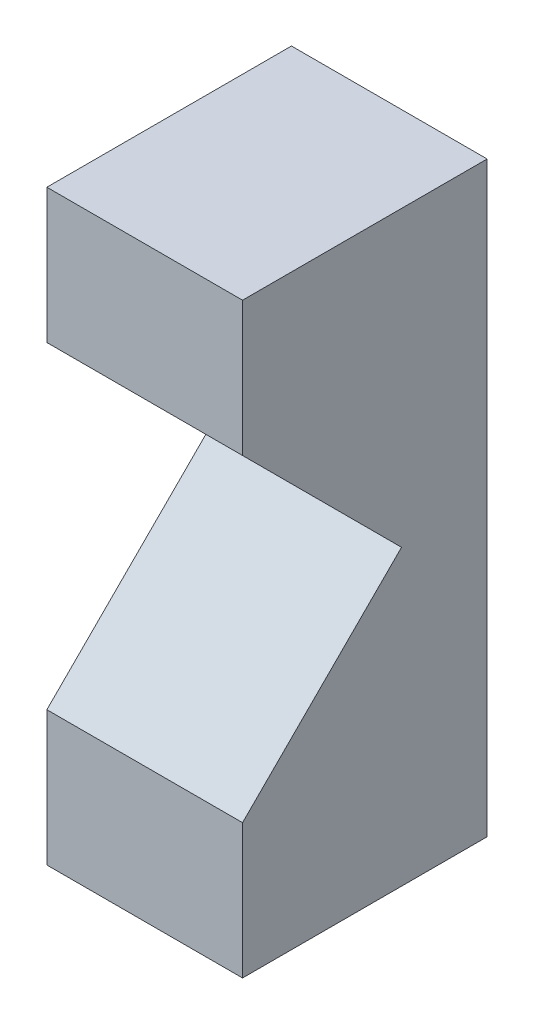
ISO-10303-21;
HEADER;
FILE_DESCRIPTION(('STEP AP214'),'2;1');
FILE_NAME('part.step','',(''),(''),'','','');
FILE_SCHEMA(('AUTOMOTIVE_DESIGN { 1 0 10303 214 1 1 1 1 }'));
ENDSEC;
DATA;
#1=APPLICATION_CONTEXT('core data for automotive mechanical design processes');
#2=APPLICATION_PROTOCOL_DEFINITION('international standard','automotive_design',2000,#1);
#3=PRODUCT_CONTEXT('',#1,'mechanical');
#4=PRODUCT('Part','Part','',(#3));
#5=PRODUCT_RELATED_PRODUCT_CATEGORY('part','',(#4));
#6=PRODUCT_DEFINITION_FORMATION('','',#4);
#7=PRODUCT_DEFINITION_CONTEXT('part definition',#1,'design');
#8=PRODUCT_DEFINITION('design','',#6,#7);
#9=PRODUCT_DEFINITION_SHAPE('','',#8);
#10=(LENGTH_UNIT() NAMED_UNIT(*) SI_UNIT(.MILLI.,.METRE.));
#11=(NAMED_UNIT(*) PLANE_ANGLE_UNIT() SI_UNIT($,.RADIAN.));
#12=(NAMED_UNIT(*) SI_UNIT($,.STERADIAN.) SOLID_ANGLE_UNIT());
#13=UNCERTAINTY_MEASURE_WITH_UNIT(LENGTH_MEASURE(1.E-05),#10,'distance_accuracy_value','');
#14=(GEOMETRIC_REPRESENTATION_CONTEXT(3) GLOBAL_UNCERTAINTY_ASSIGNED_CONTEXT((#13)) GLOBAL_UNIT_ASSIGNED_CONTEXT((#10,
#11,#12)) REPRESENTATION_CONTEXT('',''));
#15=CARTESIAN_POINT('',(0.,0.,0.));
#16=DIRECTION('',(0.,0.,1.));
#17=DIRECTION('',(1.,0.,0.));
#18=AXIS2_PLACEMENT_3D('',#15,#16,#17);
#19=CARTESIAN_POINT('',(12.7,19.05,0.));
#20=DIRECTION('',(0.,0.,-1.));
#21=DIRECTION('',(0.,1.,0.));
#22=AXIS2_PLACEMENT_3D('',#19,#20,#21);
#23=PLANE('',#22);
#24=DIRECTION('',(0.,-1.,0.));
#25=VECTOR('',#24,1.);
#26=CARTESIAN_POINT('',(0.,19.05,0.));
#27=LINE('',#26,#25);
#28=CARTESIAN_POINT('',(0.,19.05,0.));
#29=VERTEX_POINT('',#28);
#30=CARTESIAN_POINT('',(0.,10.31875,0.));
#31=VERTEX_POINT('',#30);
#32=EDGE_CURVE('E123',#29,#31,#27,.T.);
#33=ORIENTED_EDGE('',*,*,#32,.T.);
#34=DIRECTION('',(-1.,0.,0.));
#35=VECTOR('',#34,1.);
#36=CARTESIAN_POINT('',(12.7,10.31875,0.));
#37=LINE('',#36,#35);
#38=CARTESIAN_POINT('',(12.7,10.31875,0.));
#39=VERTEX_POINT('',#38);
#40=EDGE_CURVE('E11',#39,#31,#37,.T.);
#41=ORIENTED_EDGE('',*,*,#40,.F.);
#42=DIRECTION('',(0.,-1.,0.));
#43=VECTOR('',#42,1.);
#44=CARTESIAN_POINT('',(12.7,19.05,0.));
#45=LINE('',#44,#43);
#46=CARTESIAN_POINT('',(12.7,19.05,0.));
#47=VERTEX_POINT('',#46);
#48=EDGE_CURVE('E135',#47,#39,#45,.T.);
#49=ORIENTED_EDGE('',*,*,#48,.F.);
#50=DIRECTION('',(-1.,0.,0.));
#51=VECTOR('',#50,1.);
#52=CARTESIAN_POINT('',(12.7,19.05,0.));
#53=LINE('',#52,#51);
#54=EDGE_CURVE('E119',#47,#29,#53,.T.);
#55=ORIENTED_EDGE('',*,*,#54,.T.);
#56=EDGE_LOOP('',(#33,#41,#49,#55));
#57=FACE_BOUND('',#56,.T.);
#58=ADVANCED_FACE('F33',(#57),#23,.F.);
#59=CARTESIAN_POINT('',(12.7,10.31875,0.));
#60=DIRECTION('',(0.,0.707106781186548,-0.707106781186548));
#61=DIRECTION('',(0.,0.707106781186548,0.707106781186548));
#62=AXIS2_PLACEMENT_3D('',#59,#60,#61);
#63=PLANE('',#62);
#64=DIRECTION('',(0.,-0.707106781186548,-0.707106781186548));
#65=VECTOR('',#64,1.);
#66=CARTESIAN_POINT('',(0.,10.31875,0.));
#67=LINE('',#66,#65);
#68=CARTESIAN_POINT('',(0.,0.,-10.31875));
#69=VERTEX_POINT('',#68);
#70=EDGE_CURVE('E126',#31,#69,#67,.T.);
#71=ORIENTED_EDGE('',*,*,#70,.T.);
#72=DIRECTION('',(-1.,0.,0.));
#73=VECTOR('',#72,1.);
#74=CARTESIAN_POINT('',(12.7,0.,-10.31875));
#75=LINE('',#74,#73);
#76=CARTESIAN_POINT('',(12.7,0.,-10.31875));
#77=VERTEX_POINT('',#76);
#78=EDGE_CURVE('E41',#77,#69,#75,.T.);
#79=ORIENTED_EDGE('',*,*,#78,.F.);
#80=DIRECTION('',(0.,-0.707106781186548,-0.707106781186548));
#81=VECTOR('',#80,1.);
#82=CARTESIAN_POINT('',(12.7,10.31875,0.));
#83=LINE('',#82,#81);
#84=EDGE_CURVE('E89',#39,#77,#83,.T.);
#85=ORIENTED_EDGE('',*,*,#84,.F.);
#86=ORIENTED_EDGE('',*,*,#40,.T.);
#87=EDGE_LOOP('',(#71,#79,#85,#86));
#88=FACE_BOUND('',#87,.T.);
#89=ADVANCED_FACE('F160',(#88),#63,.F.);
#90=CARTESIAN_POINT('',(12.7,0.,-10.31875));
#91=DIRECTION('',(0.,-0.707106781186548,-0.707106781186548));
#92=DIRECTION('',(0.,0.707106781186548,-0.707106781186548));
#93=AXIS2_PLACEMENT_3D('',#90,#91,#92);
#94=PLANE('',#93);
#95=DIRECTION('',(0.,-0.707106781186548,0.707106781186548));
#96=VECTOR('',#95,1.);
#97=CARTESIAN_POINT('',(0.,0.,-10.31875));
#98=LINE('',#97,#96);
#99=CARTESIAN_POINT('',(0.,-10.31875,0.));
#100=VERTEX_POINT('',#99);
#101=EDGE_CURVE('E128',#69,#100,#98,.T.);
#102=ORIENTED_EDGE('',*,*,#101,.T.);
#103=DIRECTION('',(-1.,0.,0.));
#104=VECTOR('',#103,1.);
#105=CARTESIAN_POINT('',(12.7,-10.31875,0.));
#106=LINE('',#105,#104);
#107=CARTESIAN_POINT('',(12.7,-10.31875,0.));
#108=VERTEX_POINT('',#107);
#109=EDGE_CURVE('E139',#108,#100,#106,.T.);
#110=ORIENTED_EDGE('',*,*,#109,.F.);
#111=DIRECTION('',(0.,-0.707106781186548,0.707106781186548));
#112=VECTOR('',#111,1.);
#113=CARTESIAN_POINT('',(12.7,0.,-10.31875));
#114=LINE('',#113,#112);
#115=EDGE_CURVE('E147',#77,#108,#114,.T.);
#116=ORIENTED_EDGE('',*,*,#115,.F.);
#117=ORIENTED_EDGE('',*,*,#78,.T.);
#118=EDGE_LOOP('',(#102,#110,#116,#117));
#119=FACE_BOUND('',#118,.T.);
#120=ADVANCED_FACE('F145',(#119),#94,.F.);
#121=CARTESIAN_POINT('',(12.7,-10.31875,0.));
#122=DIRECTION('',(0.,0.,-1.));
#123=DIRECTION('',(0.,1.,0.));
#124=AXIS2_PLACEMENT_3D('',#121,#122,#123);
#125=PLANE('',#124);
#126=DIRECTION('',(0.,-1.,0.));
#127=VECTOR('',#126,1.);
#128=CARTESIAN_POINT('',(0.,-10.31875,0.));
#129=LINE('',#128,#127);
#130=CARTESIAN_POINT('',(0.,-19.05,0.));
#131=VERTEX_POINT('',#130);
#132=EDGE_CURVE('E130',#100,#131,#129,.T.);
#133=ORIENTED_EDGE('',*,*,#132,.T.);
#134=DIRECTION('',(-1.,0.,0.));
#135=VECTOR('',#134,1.);
#136=CARTESIAN_POINT('',(12.7,-19.05,0.));
#137=LINE('',#136,#135);
#138=CARTESIAN_POINT('',(12.7,-19.05,0.));
#139=VERTEX_POINT('',#138);
#140=EDGE_CURVE('E114',#139,#131,#137,.T.);
#141=ORIENTED_EDGE('',*,*,#140,.F.);
#142=DIRECTION('',(0.,-1.,0.));
#143=VECTOR('',#142,1.);
#144=CARTESIAN_POINT('',(12.7,-10.31875,0.));
#145=LINE('',#144,#143);
#146=EDGE_CURVE('E105',#108,#139,#145,.T.);
#147=ORIENTED_EDGE('',*,*,#146,.F.);
#148=ORIENTED_EDGE('',*,*,#109,.T.);
#149=EDGE_LOOP('',(#133,#141,#147,#148));
#150=FACE_BOUND('',#149,.T.);
#151=ADVANCED_FACE('F153',(#150),#125,.F.);
#152=CARTESIAN_POINT('',(12.7,-19.05,0.));
#153=DIRECTION('',(0.,1.,0.));
#154=DIRECTION('',(0.,0.,1.));
#155=AXIS2_PLACEMENT_3D('',#152,#153,#154);
#156=PLANE('',#155);
#157=DIRECTION('',(0.,0.,-1.));
#158=VECTOR('',#157,1.);
#159=CARTESIAN_POINT('',(0.,-19.05,0.));
#160=LINE('',#159,#158);
#161=CARTESIAN_POINT('',(0.,-19.05,-15.875));
#162=VERTEX_POINT('',#161);
#163=EDGE_CURVE('E113',#131,#162,#160,.T.);
#164=ORIENTED_EDGE('',*,*,#163,.T.);
#165=DIRECTION('',(-1.,0.,0.));
#166=VECTOR('',#165,1.);
#167=CARTESIAN_POINT('',(12.7,-19.05,-15.875));
#168=LINE('',#167,#166);
#169=CARTESIAN_POINT('',(12.7,-19.05,-15.875));
#170=VERTEX_POINT('',#169);
#171=EDGE_CURVE('E110',#170,#162,#168,.T.);
#172=ORIENTED_EDGE('',*,*,#171,.F.);
#173=DIRECTION('',(0.,0.,-1.));
#174=VECTOR('',#173,1.);
#175=CARTESIAN_POINT('',(12.7,-19.05,0.));
#176=LINE('',#175,#174);
#177=EDGE_CURVE('E99',#139,#170,#176,.T.);
#178=ORIENTED_EDGE('',*,*,#177,.F.);
#179=ORIENTED_EDGE('',*,*,#140,.T.);
#180=EDGE_LOOP('',(#164,#172,#178,#179));
#181=FACE_BOUND('',#180,.T.);
#182=ADVANCED_FACE('F111',(#181),#156,.F.);
#183=CARTESIAN_POINT('',(12.7,-19.05,-15.875));
#184=DIRECTION('',(0.,0.,1.));
#185=DIRECTION('',(1.,0.,0.));
#186=AXIS2_PLACEMENT_3D('',#183,#184,#185);
#187=PLANE('',#186);
#188=DIRECTION('',(0.,1.,0.));
#189=VECTOR('',#188,1.);
#190=CARTESIAN_POINT('',(0.,-19.05,-15.875));
#191=LINE('',#190,#189);
#192=CARTESIAN_POINT('',(0.,19.05,-15.875));
#193=VERTEX_POINT('',#192);
#194=EDGE_CURVE('E75',#162,#193,#191,.T.);
#195=ORIENTED_EDGE('',*,*,#194,.T.);
#196=DIRECTION('',(-1.,0.,0.));
#197=VECTOR('',#196,1.);
#198=CARTESIAN_POINT('',(12.7,19.05,-15.875));
#199=LINE('',#198,#197);
#200=CARTESIAN_POINT('',(12.7,19.05,-15.875));
#201=VERTEX_POINT('',#200);
#202=EDGE_CURVE('E115',#201,#193,#199,.T.);
#203=ORIENTED_EDGE('',*,*,#202,.F.);
#204=DIRECTION('',(0.,1.,0.));
#205=VECTOR('',#204,1.);
#206=CARTESIAN_POINT('',(12.7,-19.05,-15.875));
#207=LINE('',#206,#205);
#208=EDGE_CURVE('E103',#170,#201,#207,.T.);
#209=ORIENTED_EDGE('',*,*,#208,.F.);
#210=ORIENTED_EDGE('',*,*,#171,.T.);
#211=EDGE_LOOP('',(#195,#203,#209,#210));
#212=FACE_BOUND('',#211,.T.);
#213=ADVANCED_FACE('F117',(#212),#187,.F.);
#214=CARTESIAN_POINT('',(12.7,19.05,-15.875));
#215=DIRECTION('',(0.,-1.,0.));
#216=DIRECTION('',(0.,0.,-1.));
#217=AXIS2_PLACEMENT_3D('',#214,#215,#216);
#218=PLANE('',#217);
#219=DIRECTION('',(0.,0.,1.));
#220=VECTOR('',#219,1.);
#221=CARTESIAN_POINT('',(0.,19.05,-15.875));
#222=LINE('',#221,#220);
#223=EDGE_CURVE('E81',#193,#29,#222,.T.);
#224=ORIENTED_EDGE('',*,*,#223,.T.);
#225=ORIENTED_EDGE('',*,*,#54,.F.);
#226=DIRECTION('',(0.,0.,1.));
#227=VECTOR('',#226,1.);
#228=CARTESIAN_POINT('',(12.7,19.05,-15.875));
#229=LINE('',#228,#227);
#230=EDGE_CURVE('E49',#201,#47,#229,.T.);
#231=ORIENTED_EDGE('',*,*,#230,.F.);
#232=ORIENTED_EDGE('',*,*,#202,.T.);
#233=EDGE_LOOP('',(#224,#225,#231,#232));
#234=FACE_BOUND('',#233,.T.);
#235=ADVANCED_FACE('F174',(#234),#218,.F.);
#236=CARTESIAN_POINT('',(12.7,0.,0.));
#237=DIRECTION('',(1.,0.,0.));
#238=DIRECTION('',(0.,0.,-1.));
#239=AXIS2_PLACEMENT_3D('',#236,#237,#238);
#240=PLANE('',#239);
#241=ORIENTED_EDGE('',*,*,#48,.T.);
#242=ORIENTED_EDGE('',*,*,#84,.T.);
#243=ORIENTED_EDGE('',*,*,#115,.T.);
#244=ORIENTED_EDGE('',*,*,#146,.T.);
#245=ORIENTED_EDGE('',*,*,#177,.T.);
#246=ORIENTED_EDGE('',*,*,#208,.T.);
#247=ORIENTED_EDGE('',*,*,#230,.T.);
#248=EDGE_LOOP('',(#241,#242,#243,#244,#245,#246,#247));
#249=FACE_BOUND('',#248,.T.);
#250=ADVANCED_FACE('F101',(#249),#240,.T.);
#251=CARTESIAN_POINT('',(0.,0.,0.));
#252=DIRECTION('',(1.,0.,0.));
#253=DIRECTION('',(0.,0.,-1.));
#254=AXIS2_PLACEMENT_3D('',#251,#252,#253);
#255=PLANE('',#254);
#256=ORIENTED_EDGE('',*,*,#32,.F.);
#257=ORIENTED_EDGE('',*,*,#223,.F.);
#258=ORIENTED_EDGE('',*,*,#194,.F.);
#259=ORIENTED_EDGE('',*,*,#163,.F.);
#260=ORIENTED_EDGE('',*,*,#132,.F.);
#261=ORIENTED_EDGE('',*,*,#101,.F.);
#262=ORIENTED_EDGE('',*,*,#70,.F.);
#263=EDGE_LOOP('',(#256,#257,#258,#259,#260,#261,#262));
#264=FACE_BOUND('',#263,.T.);
#265=ADVANCED_FACE('F151',(#264),#255,.F.);
#266=CLOSED_SHELL('',(#58,#89,#120,#151,#182,#213,#235,#250,#265));
#267=MANIFOLD_SOLID_BREP('B2',#266);
#268=ADVANCED_BREP_SHAPE_REPRESENTATION('',(#18,#267),#14);
#269=SHAPE_DEFINITION_REPRESENTATION(#9,#268);
ENDSEC;
END-ISO-10303-21;
